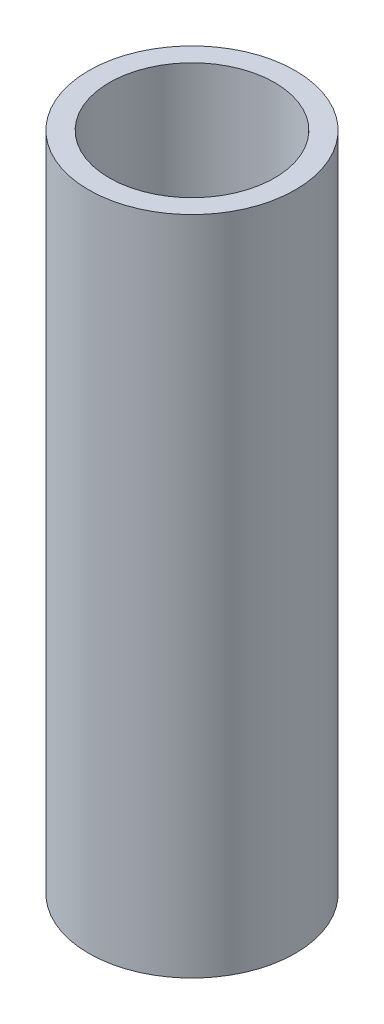
ISO-10303-21;
HEADER;
FILE_DESCRIPTION(('STEP AP214'),'2;1');
FILE_NAME('part.step','',(''),(''),'','','');
FILE_SCHEMA(('AUTOMOTIVE_DESIGN { 1 0 10303 214 1 1 1 1 }'));
ENDSEC;
DATA;
#1=APPLICATION_CONTEXT('core data for automotive mechanical design processes');
#2=APPLICATION_PROTOCOL_DEFINITION('international standard','automotive_design',2000,#1);
#3=PRODUCT_CONTEXT('',#1,'mechanical');
#4=PRODUCT('Part','Part','',(#3));
#5=PRODUCT_RELATED_PRODUCT_CATEGORY('part','',(#4));
#6=PRODUCT_DEFINITION_FORMATION('','',#4);
#7=PRODUCT_DEFINITION_CONTEXT('part definition',#1,'design');
#8=PRODUCT_DEFINITION('design','',#6,#7);
#9=PRODUCT_DEFINITION_SHAPE('','',#8);
#10=(LENGTH_UNIT() NAMED_UNIT(*) SI_UNIT(.MILLI.,.METRE.));
#11=(NAMED_UNIT(*) PLANE_ANGLE_UNIT() SI_UNIT($,.RADIAN.));
#12=(NAMED_UNIT(*) SI_UNIT($,.STERADIAN.) SOLID_ANGLE_UNIT());
#13=UNCERTAINTY_MEASURE_WITH_UNIT(LENGTH_MEASURE(1.E-05),#10,'distance_accuracy_value','');
#14=(GEOMETRIC_REPRESENTATION_CONTEXT(3) GLOBAL_UNCERTAINTY_ASSIGNED_CONTEXT((#13)) GLOBAL_UNIT_ASSIGNED_CONTEXT((#10,
#11,#12)) REPRESENTATION_CONTEXT('',''));
#15=CARTESIAN_POINT('',(0.,0.,0.));
#16=DIRECTION('',(0.,0.,1.));
#17=DIRECTION('',(1.,0.,0.));
#18=AXIS2_PLACEMENT_3D('',#15,#16,#17);
#19=CARTESIAN_POINT('',(0.,40.,0.));
#20=DIRECTION('',(0.,1.,0.));
#21=DIRECTION('',(0.,0.,1.));
#22=AXIS2_PLACEMENT_3D('',#19,#20,#21);
#23=PLANE('',#22);
#24=CARTESIAN_POINT('',(0.,40.,0.));
#25=DIRECTION('',(0.,1.,0.));
#26=DIRECTION('',(0.,0.,1.));
#27=AXIS2_PLACEMENT_3D('',#24,#25,#26);
#28=CIRCLE('',#27,12.5);
#29=CARTESIAN_POINT('',(0.,40.,12.5));
#30=VERTEX_POINT('',#29);
#31=EDGE_CURVE('E10',#30,#30,#28,.T.);
#32=ORIENTED_EDGE('',*,*,#31,.T.);
#33=EDGE_LOOP('',(#32));
#34=FACE_BOUND('',#33,.T.);
#35=CARTESIAN_POINT('',(0.,40.,0.));
#36=DIRECTION('',(0.,1.,0.));
#37=DIRECTION('',(0.,0.,1.));
#38=AXIS2_PLACEMENT_3D('',#35,#36,#37);
#39=CIRCLE('',#38,10.);
#40=CARTESIAN_POINT('',(0.,40.,10.));
#41=VERTEX_POINT('',#40);
#42=EDGE_CURVE('E46',#41,#41,#39,.T.);
#43=ORIENTED_EDGE('',*,*,#42,.F.);
#44=EDGE_LOOP('',(#43));
#45=FACE_BOUND('',#44,.T.);
#46=ADVANCED_FACE('F35',(#34,#45),#23,.T.);
#47=CARTESIAN_POINT('',(0.,-40.,0.));
#48=DIRECTION('',(0.,1.,0.));
#49=DIRECTION('',(0.,0.,1.));
#50=AXIS2_PLACEMENT_3D('',#47,#48,#49);
#51=PLANE('',#50);
#52=CARTESIAN_POINT('',(0.,-40.,0.));
#53=DIRECTION('',(0.,1.,0.));
#54=DIRECTION('',(0.,0.,1.));
#55=AXIS2_PLACEMENT_3D('',#52,#53,#54);
#56=CIRCLE('',#55,12.5);
#57=CARTESIAN_POINT('',(0.,-40.,12.5));
#58=VERTEX_POINT('',#57);
#59=EDGE_CURVE('E39',#58,#58,#56,.T.);
#60=ORIENTED_EDGE('',*,*,#59,.F.);
#61=EDGE_LOOP('',(#60));
#62=FACE_BOUND('',#61,.T.);
#63=CARTESIAN_POINT('',(0.,-40.,0.));
#64=DIRECTION('',(0.,1.,0.));
#65=DIRECTION('',(0.,0.,1.));
#66=AXIS2_PLACEMENT_3D('',#63,#64,#65);
#67=CIRCLE('',#66,10.);
#68=CARTESIAN_POINT('',(0.,-40.,10.));
#69=VERTEX_POINT('',#68);
#70=EDGE_CURVE('E48',#69,#69,#67,.T.);
#71=ORIENTED_EDGE('',*,*,#70,.T.);
#72=EDGE_LOOP('',(#71));
#73=FACE_BOUND('',#72,.T.);
#74=ADVANCED_FACE('F58',(#62,#73),#51,.F.);
#75=CARTESIAN_POINT('',(0.,40.,0.));
#76=DIRECTION('',(0.,-1.,0.));
#77=DIRECTION('',(0.,0.,-1.));
#78=AXIS2_PLACEMENT_3D('',#75,#76,#77);
#79=CYLINDRICAL_SURFACE('',#78,12.5);
#80=ORIENTED_EDGE('',*,*,#31,.F.);
#81=EDGE_LOOP('',(#80));
#82=FACE_BOUND('',#81,.T.);
#83=ORIENTED_EDGE('',*,*,#59,.T.);
#84=EDGE_LOOP('',(#83));
#85=FACE_BOUND('',#84,.T.);
#86=ADVANCED_FACE('F37',(#82,#85),#79,.T.);
#87=CARTESIAN_POINT('',(0.,40.,0.));
#88=DIRECTION('',(0.,-1.,0.));
#89=DIRECTION('',(0.,0.,-1.));
#90=AXIS2_PLACEMENT_3D('',#87,#88,#89);
#91=CYLINDRICAL_SURFACE('',#90,10.);
#92=ORIENTED_EDGE('',*,*,#42,.T.);
#93=EDGE_LOOP('',(#92));
#94=FACE_BOUND('',#93,.T.);
#95=ORIENTED_EDGE('',*,*,#70,.F.);
#96=EDGE_LOOP('',(#95));
#97=FACE_BOUND('',#96,.T.);
#98=ADVANCED_FACE('F54',(#94,#97),#91,.F.);
#99=CLOSED_SHELL('',(#46,#74,#86,#98));
#100=MANIFOLD_SOLID_BREP('B2',#99);
#101=ADVANCED_BREP_SHAPE_REPRESENTATION('',(#18,#100),#14);
#102=SHAPE_DEFINITION_REPRESENTATION(#9,#101);
ENDSEC;
END-ISO-10303-21;
